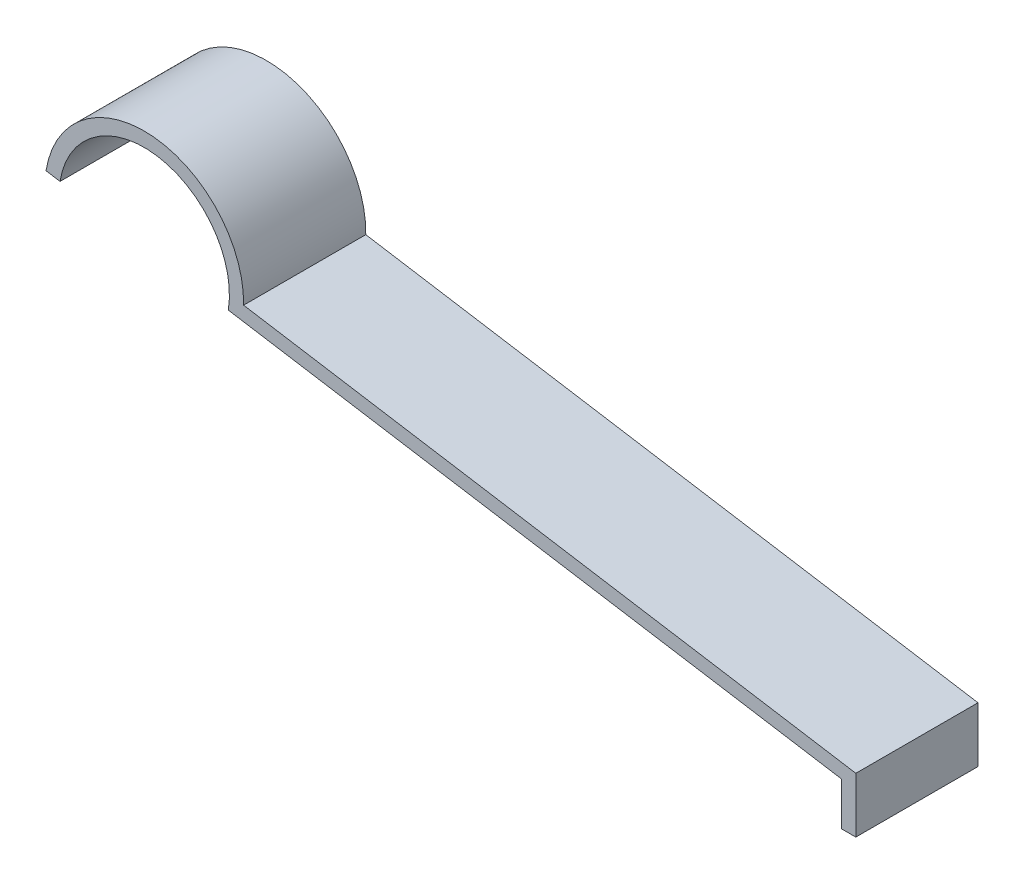
ISO-10303-21;
HEADER;
FILE_DESCRIPTION(('STEP AP214'),'2;1');
FILE_NAME('part.step','',(''),(''),'','','');
FILE_SCHEMA(('AUTOMOTIVE_DESIGN { 1 0 10303 214 1 1 1 1 }'));
ENDSEC;
DATA;
#1=APPLICATION_CONTEXT('core data for automotive mechanical design processes');
#2=APPLICATION_PROTOCOL_DEFINITION('international standard','automotive_design',2000,#1);
#3=PRODUCT_CONTEXT('',#1,'mechanical');
#4=PRODUCT('Part','Part','',(#3));
#5=PRODUCT_RELATED_PRODUCT_CATEGORY('part','',(#4));
#6=PRODUCT_DEFINITION_FORMATION('','',#4);
#7=PRODUCT_DEFINITION_CONTEXT('part definition',#1,'design');
#8=PRODUCT_DEFINITION('design','',#6,#7);
#9=PRODUCT_DEFINITION_SHAPE('','',#8);
#10=(LENGTH_UNIT() NAMED_UNIT(*) SI_UNIT(.MILLI.,.METRE.));
#11=(NAMED_UNIT(*) PLANE_ANGLE_UNIT() SI_UNIT($,.RADIAN.));
#12=(NAMED_UNIT(*) SI_UNIT($,.STERADIAN.) SOLID_ANGLE_UNIT());
#13=UNCERTAINTY_MEASURE_WITH_UNIT(LENGTH_MEASURE(1.E-05),#10,'distance_accuracy_value','');
#14=(GEOMETRIC_REPRESENTATION_CONTEXT(3) GLOBAL_UNCERTAINTY_ASSIGNED_CONTEXT((#13)) GLOBAL_UNIT_ASSIGNED_CONTEXT((#10,
#11,#12)) REPRESENTATION_CONTEXT('',''));
#15=CARTESIAN_POINT('',(0.,0.,0.));
#16=DIRECTION('',(0.,0.,1.));
#17=DIRECTION('',(1.,0.,0.));
#18=AXIS2_PLACEMENT_3D('',#15,#16,#17);
#19=CARTESIAN_POINT('',(0.5,0.,2.15));
#20=DIRECTION('',(0.,1.,0.));
#21=DIRECTION('',(-1.,0.,0.));
#22=AXIS2_PLACEMENT_3D('',#19,#20,#21);
#23=PLANE('',#22);
#24=DIRECTION('',(1.,0.,0.));
#25=VECTOR('',#24,1.);
#26=CARTESIAN_POINT('',(0.5,0.,-2.15));
#27=LINE('',#26,#25);
#28=CARTESIAN_POINT('',(0.,0.,-2.15));
#29=VERTEX_POINT('',#28);
#30=CARTESIAN_POINT('',(0.5,0.,-2.15));
#31=VERTEX_POINT('',#30);
#32=EDGE_CURVE('E84',#29,#31,#27,.T.);
#33=ORIENTED_EDGE('',*,*,#32,.T.);
#34=DIRECTION('',(0.,0.,-1.));
#35=VECTOR('',#34,1.);
#36=CARTESIAN_POINT('',(0.5,0.,2.15));
#37=LINE('',#36,#35);
#38=CARTESIAN_POINT('',(0.5,0.,2.15));
#39=VERTEX_POINT('',#38);
#40=EDGE_CURVE('E11',#39,#31,#37,.T.);
#41=ORIENTED_EDGE('',*,*,#40,.F.);
#42=DIRECTION('',(1.,0.,0.));
#43=VECTOR('',#42,1.);
#44=CARTESIAN_POINT('',(0.5,0.,2.15));
#45=LINE('',#44,#43);
#46=CARTESIAN_POINT('',(0.,0.,2.15));
#47=VERTEX_POINT('',#46);
#48=EDGE_CURVE('E111',#47,#39,#45,.T.);
#49=ORIENTED_EDGE('',*,*,#48,.F.);
#50=DIRECTION('',(0.,0.,-1.));
#51=VECTOR('',#50,1.);
#52=CARTESIAN_POINT('',(0.,0.,2.15));
#53=LINE('',#52,#51);
#54=EDGE_CURVE('E97',#47,#29,#53,.T.);
#55=ORIENTED_EDGE('',*,*,#54,.T.);
#56=EDGE_LOOP('',(#33,#41,#49,#55));
#57=FACE_BOUND('',#56,.T.);
#58=ADVANCED_FACE('F16',(#57),#23,.F.);
#59=CARTESIAN_POINT('',(0.5,1.9454581226,2.15));
#60=DIRECTION('',(-1.,0.,0.));
#61=DIRECTION('',(0.,-1.,0.));
#62=AXIS2_PLACEMENT_3D('',#59,#60,#61);
#63=PLANE('',#62);
#64=DIRECTION('',(0.,1.,0.));
#65=VECTOR('',#64,1.);
#66=CARTESIAN_POINT('',(0.5,1.9454581226,-2.15));
#67=LINE('',#66,#65);
#68=CARTESIAN_POINT('',(0.5,1.9454581226,-2.15));
#69=VERTEX_POINT('',#68);
#70=EDGE_CURVE('E80',#31,#69,#67,.T.);
#71=ORIENTED_EDGE('',*,*,#70,.T.);
#72=DIRECTION('',(0.,0.,-1.));
#73=VECTOR('',#72,1.);
#74=CARTESIAN_POINT('',(0.5,1.9454581226,2.15));
#75=LINE('',#74,#73);
#76=CARTESIAN_POINT('',(0.5,1.9454581226,2.15));
#77=VERTEX_POINT('',#76);
#78=EDGE_CURVE('E23',#77,#69,#75,.T.);
#79=ORIENTED_EDGE('',*,*,#78,.F.);
#80=DIRECTION('',(0.,1.,0.));
#81=VECTOR('',#80,1.);
#82=CARTESIAN_POINT('',(0.5,1.9454581226,2.15));
#83=LINE('',#82,#81);
#84=EDGE_CURVE('E93',#39,#77,#83,.T.);
#85=ORIENTED_EDGE('',*,*,#84,.F.);
#86=ORIENTED_EDGE('',*,*,#40,.T.);
#87=EDGE_LOOP('',(#71,#79,#85,#86));
#88=FACE_BOUND('',#87,.T.);
#89=ADVANCED_FACE('F92',(#88),#63,.F.);
#90=CARTESIAN_POINT('',(-21.0456504402222,5.43895121023184,2.15));
#91=DIRECTION('',(-0.160053473035748,-0.987108345506812,0.));
#92=DIRECTION('',(0.987108345506812,-0.160053473035748,0.));
#93=AXIS2_PLACEMENT_3D('',#90,#91,#92);
#94=PLANE('',#93);
#95=DIRECTION('',(-0.987108345506812,0.160053473035748,0.));
#96=VECTOR('',#95,1.);
#97=CARTESIAN_POINT('',(-21.0456504402222,5.43895121023184,-2.15));
#98=LINE('',#97,#96);
#99=CARTESIAN_POINT('',(-21.0456504402222,5.43895121023184,-2.15));
#100=VERTEX_POINT('',#99);
#101=EDGE_CURVE('E86',#69,#100,#98,.T.);
#102=ORIENTED_EDGE('',*,*,#101,.T.);
#103=DIRECTION('',(0.,0.,-1.));
#104=VECTOR('',#103,1.);
#105=CARTESIAN_POINT('',(-21.0456504402222,5.43895121023184,2.15));
#106=LINE('',#105,#104);
#107=CARTESIAN_POINT('',(-21.0456504402222,5.43895121023184,2.15));
#108=VERTEX_POINT('',#107);
#109=EDGE_CURVE('E137',#108,#100,#106,.T.);
#110=ORIENTED_EDGE('',*,*,#109,.F.);
#111=DIRECTION('',(-0.987108345506812,0.160053473035748,0.));
#112=VECTOR('',#111,1.);
#113=CARTESIAN_POINT('',(-21.0456504402222,5.43895121023184,2.15));
#114=LINE('',#113,#112);
#115=EDGE_CURVE('E114',#77,#108,#114,.T.);
#116=ORIENTED_EDGE('',*,*,#115,.F.);
#117=ORIENTED_EDGE('',*,*,#78,.T.);
#118=EDGE_LOOP('',(#102,#110,#116,#117));
#119=FACE_BOUND('',#118,.T.);
#120=ADVANCED_FACE('F141',(#119),#94,.F.);
#121=CARTESIAN_POINT('',(-24.5451207907261,5.49983853192998,2.15));
#122=DIRECTION('',(0.,0.,-1.));
#123=DIRECTION('',(-1.,0.,0.));
#124=AXIS2_PLACEMENT_3D('',#121,#122,#123);
#125=CYLINDRICAL_SURFACE('',#124,3.5);
#126=CARTESIAN_POINT('',(-24.5451207907261,5.49983853192998,-2.15));
#127=DIRECTION('',(0.,0.,1.));
#128=DIRECTION('',(-1.,0.,0.));
#129=AXIS2_PLACEMENT_3D('',#126,#127,#128);
#130=CIRCLE('',#129,3.5);
#131=CARTESIAN_POINT('',(-28.,6.0600256875551,-2.15));
#132=VERTEX_POINT('',#131);
#133=EDGE_CURVE('E101',#100,#132,#130,.T.);
#134=ORIENTED_EDGE('',*,*,#133,.T.);
#135=DIRECTION('',(0.,0.,-1.));
#136=VECTOR('',#135,1.);
#137=CARTESIAN_POINT('',(-28.,6.0600256875551,2.15));
#138=LINE('',#137,#136);
#139=CARTESIAN_POINT('',(-28.,6.0600256875551,2.15));
#140=VERTEX_POINT('',#139);
#141=EDGE_CURVE('E134',#140,#132,#138,.T.);
#142=ORIENTED_EDGE('',*,*,#141,.F.);
#143=CARTESIAN_POINT('',(-24.5451207907261,5.49983853192998,2.15));
#144=DIRECTION('',(0.,0.,1.));
#145=DIRECTION('',(-1.,0.,0.));
#146=AXIS2_PLACEMENT_3D('',#143,#144,#145);
#147=CIRCLE('',#146,3.5);
#148=EDGE_CURVE('E116',#108,#140,#147,.T.);
#149=ORIENTED_EDGE('',*,*,#148,.F.);
#150=ORIENTED_EDGE('',*,*,#109,.T.);
#151=EDGE_LOOP('',(#134,#142,#149,#150));
#152=FACE_BOUND('',#151,.T.);
#153=ADVANCED_FACE('F149',(#152),#125,.T.);
#154=CARTESIAN_POINT('',(-27.5064458272466,5.97999895103722,2.15));
#155=DIRECTION('',(0.16005347303575,0.987108345506811,0.));
#156=DIRECTION('',(-0.987108345506811,0.16005347303575,0.));
#157=AXIS2_PLACEMENT_3D('',#154,#155,#156);
#158=PLANE('',#157);
#159=DIRECTION('',(0.987108345506811,-0.16005347303575,0.));
#160=VECTOR('',#159,1.);
#161=CARTESIAN_POINT('',(-27.5064458272466,5.97999895103722,-2.15));
#162=LINE('',#161,#160);
#163=CARTESIAN_POINT('',(-27.5064458272466,5.97999895103722,-2.15));
#164=VERTEX_POINT('',#163);
#165=EDGE_CURVE('E103',#132,#164,#162,.T.);
#166=ORIENTED_EDGE('',*,*,#165,.T.);
#167=DIRECTION('',(0.,0.,-1.));
#168=VECTOR('',#167,1.);
#169=CARTESIAN_POINT('',(-27.5064458272466,5.97999895103722,2.15));
#170=LINE('',#169,#168);
#171=CARTESIAN_POINT('',(-27.5064458272466,5.97999895103722,2.15));
#172=VERTEX_POINT('',#171);
#173=EDGE_CURVE('E131',#172,#164,#170,.T.);
#174=ORIENTED_EDGE('',*,*,#173,.F.);
#175=DIRECTION('',(0.987108345506811,-0.16005347303575,0.));
#176=VECTOR('',#175,1.);
#177=CARTESIAN_POINT('',(-27.5064458272466,5.97999895103722,2.15));
#178=LINE('',#177,#176);
#179=EDGE_CURVE('E118',#140,#172,#178,.T.);
#180=ORIENTED_EDGE('',*,*,#179,.F.);
#181=ORIENTED_EDGE('',*,*,#141,.T.);
#182=EDGE_LOOP('',(#166,#174,#180,#181));
#183=FACE_BOUND('',#182,.T.);
#184=ADVANCED_FACE('F152',(#183),#158,.F.);
#185=CARTESIAN_POINT('',(-24.5451207907261,5.49983853192998,2.15));
#186=DIRECTION('',(0.,0.,-1.));
#187=DIRECTION('',(-1.,0.,0.));
#188=AXIS2_PLACEMENT_3D('',#185,#186,#187);
#189=CYLINDRICAL_SURFACE('',#188,3.);
#190=CARTESIAN_POINT('',(-24.5451207907261,5.49983853192998,-2.15));
#191=DIRECTION('',(0.,0.,-1.));
#192=DIRECTION('',(-1.,0.,0.));
#193=AXIS2_PLACEMENT_3D('',#190,#191,#192);
#194=CIRCLE('',#193,3.);
#195=CARTESIAN_POINT('',(-21.5837957542057,5.01967811282274,-2.15));
#196=VERTEX_POINT('',#195);
#197=EDGE_CURVE('E105',#164,#196,#194,.T.);
#198=ORIENTED_EDGE('',*,*,#197,.T.);
#199=DIRECTION('',(0.,0.,-1.));
#200=VECTOR('',#199,1.);
#201=CARTESIAN_POINT('',(-21.5837957542057,5.01967811282274,2.15));
#202=LINE('',#201,#200);
#203=CARTESIAN_POINT('',(-21.5837957542057,5.01967811282274,2.15));
#204=VERTEX_POINT('',#203);
#205=EDGE_CURVE('E128',#204,#196,#202,.T.);
#206=ORIENTED_EDGE('',*,*,#205,.F.);
#207=CARTESIAN_POINT('',(-24.5451207907261,5.49983853192998,2.15));
#208=DIRECTION('',(0.,0.,-1.));
#209=DIRECTION('',(-1.,0.,0.));
#210=AXIS2_PLACEMENT_3D('',#207,#208,#209);
#211=CIRCLE('',#210,3.);
#212=EDGE_CURVE('E120',#172,#204,#211,.T.);
#213=ORIENTED_EDGE('',*,*,#212,.F.);
#214=ORIENTED_EDGE('',*,*,#173,.T.);
#215=EDGE_LOOP('',(#198,#206,#213,#214));
#216=FACE_BOUND('',#215,.T.);
#217=ADVANCED_FACE('F157',(#216),#189,.F.);
#218=CARTESIAN_POINT('',(-21.5837957542057,5.01967811282274,2.15));
#219=DIRECTION('',(0.160053473035748,0.987108345506812,0.));
#220=DIRECTION('',(-0.987108345506812,0.160053473035748,0.));
#221=AXIS2_PLACEMENT_3D('',#218,#219,#220);
#222=PLANE('',#221);
#223=DIRECTION('',(0.987108345506812,-0.160053473035748,0.));
#224=VECTOR('',#223,1.);
#225=CARTESIAN_POINT('',(-21.5837957542057,5.01967811282274,-2.15));
#226=LINE('',#225,#224);
#227=CARTESIAN_POINT('',(0.,1.52,-2.15));
#228=VERTEX_POINT('',#227);
#229=EDGE_CURVE('E107',#196,#228,#226,.T.);
#230=ORIENTED_EDGE('',*,*,#229,.T.);
#231=DIRECTION('',(0.,0.,-1.));
#232=VECTOR('',#231,1.);
#233=CARTESIAN_POINT('',(0.,1.52,2.15));
#234=LINE('',#233,#232);
#235=CARTESIAN_POINT('',(0.,1.52,2.15));
#236=VERTEX_POINT('',#235);
#237=EDGE_CURVE('E125',#236,#228,#234,.T.);
#238=ORIENTED_EDGE('',*,*,#237,.F.);
#239=DIRECTION('',(0.987108345506812,-0.160053473035748,0.));
#240=VECTOR('',#239,1.);
#241=CARTESIAN_POINT('',(-21.5837957542057,5.01967811282274,2.15));
#242=LINE('',#241,#240);
#243=EDGE_CURVE('E35',#204,#236,#242,.T.);
#244=ORIENTED_EDGE('',*,*,#243,.F.);
#245=ORIENTED_EDGE('',*,*,#205,.T.);
#246=EDGE_LOOP('',(#230,#238,#244,#245));
#247=FACE_BOUND('',#246,.T.);
#248=ADVANCED_FACE('F160',(#247),#222,.F.);
#249=CARTESIAN_POINT('',(0.,0.,2.15));
#250=DIRECTION('',(1.,0.,0.));
#251=DIRECTION('',(0.,0.,-1.));
#252=AXIS2_PLACEMENT_3D('',#249,#250,#251);
#253=PLANE('',#252);
#254=DIRECTION('',(0.,-1.,0.));
#255=VECTOR('',#254,1.);
#256=CARTESIAN_POINT('',(0.,0.,-2.15));
#257=LINE('',#256,#255);
#258=EDGE_CURVE('E109',#228,#29,#257,.T.);
#259=ORIENTED_EDGE('',*,*,#258,.T.);
#260=ORIENTED_EDGE('',*,*,#54,.F.);
#261=DIRECTION('',(0.,-1.,0.));
#262=VECTOR('',#261,1.);
#263=CARTESIAN_POINT('',(0.,0.,2.15));
#264=LINE('',#263,#262);
#265=EDGE_CURVE('E30',#236,#47,#264,.T.);
#266=ORIENTED_EDGE('',*,*,#265,.F.);
#267=ORIENTED_EDGE('',*,*,#237,.T.);
#268=EDGE_LOOP('',(#259,#260,#266,#267));
#269=FACE_BOUND('',#268,.T.);
#270=ADVANCED_FACE('F162',(#269),#253,.F.);
#271=CARTESIAN_POINT('',(-24.5451207907261,5.49983853192998,2.15));
#272=DIRECTION('',(0.,0.,-1.));
#273=DIRECTION('',(-1.,0.,0.));
#274=AXIS2_PLACEMENT_3D('',#271,#272,#273);
#275=PLANE('',#274);
#276=ORIENTED_EDGE('',*,*,#48,.T.);
#277=ORIENTED_EDGE('',*,*,#84,.T.);
#278=ORIENTED_EDGE('',*,*,#115,.T.);
#279=ORIENTED_EDGE('',*,*,#148,.T.);
#280=ORIENTED_EDGE('',*,*,#179,.T.);
#281=ORIENTED_EDGE('',*,*,#212,.T.);
#282=ORIENTED_EDGE('',*,*,#243,.T.);
#283=ORIENTED_EDGE('',*,*,#265,.T.);
#284=EDGE_LOOP('',(#276,#277,#278,#279,#280,#281,#282,#283));
#285=FACE_BOUND('',#284,.T.);
#286=ADVANCED_FACE('F144',(#285),#275,.F.);
#287=CARTESIAN_POINT('',(-24.5451207907261,5.49983853192998,-2.15));
#288=DIRECTION('',(0.,0.,-1.));
#289=DIRECTION('',(-1.,0.,0.));
#290=AXIS2_PLACEMENT_3D('',#287,#288,#289);
#291=PLANE('',#290);
#292=ORIENTED_EDGE('',*,*,#32,.F.);
#293=ORIENTED_EDGE('',*,*,#258,.F.);
#294=ORIENTED_EDGE('',*,*,#229,.F.);
#295=ORIENTED_EDGE('',*,*,#197,.F.);
#296=ORIENTED_EDGE('',*,*,#165,.F.);
#297=ORIENTED_EDGE('',*,*,#133,.F.);
#298=ORIENTED_EDGE('',*,*,#101,.F.);
#299=ORIENTED_EDGE('',*,*,#70,.F.);
#300=EDGE_LOOP('',(#292,#293,#294,#295,#296,#297,#298,#299));
#301=FACE_BOUND('',#300,.T.);
#302=ADVANCED_FACE('F81',(#301),#291,.T.);
#303=CLOSED_SHELL('',(#58,#89,#120,#153,#184,#217,#248,#270,#286,#302));
#304=MANIFOLD_SOLID_BREP('B1',#303);
#305=ADVANCED_BREP_SHAPE_REPRESENTATION('',(#18,#304),#14);
#306=SHAPE_DEFINITION_REPRESENTATION(#9,#305);
ENDSEC;
END-ISO-10303-21;
